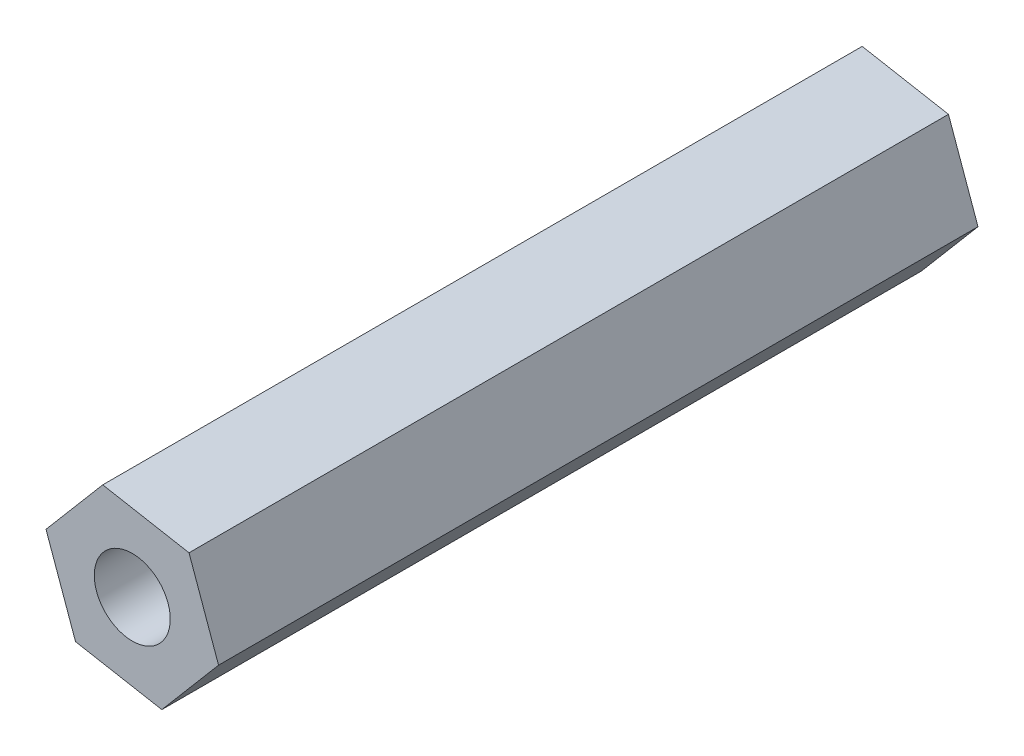
ISO-10303-21;
HEADER;
FILE_DESCRIPTION(('STEP AP214'),'2;1');
FILE_NAME('part.step','',(''),(''),'','','');
FILE_SCHEMA(('AUTOMOTIVE_DESIGN { 1 0 10303 214 1 1 1 1 }'));
ENDSEC;
DATA;
#1=APPLICATION_CONTEXT('core data for automotive mechanical design processes');
#2=APPLICATION_PROTOCOL_DEFINITION('international standard','automotive_design',2000,#1);
#3=PRODUCT_CONTEXT('',#1,'mechanical');
#4=PRODUCT('Part','Part','',(#3));
#5=PRODUCT_RELATED_PRODUCT_CATEGORY('part','',(#4));
#6=PRODUCT_DEFINITION_FORMATION('','',#4);
#7=PRODUCT_DEFINITION_CONTEXT('part definition',#1,'design');
#8=PRODUCT_DEFINITION('design','',#6,#7);
#9=PRODUCT_DEFINITION_SHAPE('','',#8);
#10=(LENGTH_UNIT() NAMED_UNIT(*) SI_UNIT(.MILLI.,.METRE.));
#11=(NAMED_UNIT(*) PLANE_ANGLE_UNIT() SI_UNIT($,.RADIAN.));
#12=(NAMED_UNIT(*) SI_UNIT($,.STERADIAN.) SOLID_ANGLE_UNIT());
#13=UNCERTAINTY_MEASURE_WITH_UNIT(LENGTH_MEASURE(1.E-05),#10,'distance_accuracy_value','');
#14=(GEOMETRIC_REPRESENTATION_CONTEXT(3) GLOBAL_UNCERTAINTY_ASSIGNED_CONTEXT((#13)) GLOBAL_UNIT_ASSIGNED_CONTEXT((#10,
#11,#12)) REPRESENTATION_CONTEXT('',''));
#15=CARTESIAN_POINT('',(0.,0.,0.));
#16=DIRECTION('',(0.,0.,1.));
#17=DIRECTION('',(1.,0.,0.));
#18=AXIS2_PLACEMENT_3D('',#15,#16,#17);
#19=CARTESIAN_POINT('',(14.100105118259,-7.40552271774973,30.));
#20=DIRECTION('',(-0.941553473498977,-0.336863557753005,0.));
#21=DIRECTION('',(0.336863557753005,-0.941553473498977,0.));
#22=AXIS2_PLACEMENT_3D('',#19,#20,#21);
#23=PLANE('',#22);
#24=DIRECTION('',(-0.336863557753005,0.941553473498977,0.));
#25=VECTOR('',#24,1.);
#26=CARTESIAN_POINT('',(14.100105118259,-7.40552271774973,0.));
#27=LINE('',#26,#25);
#28=CARTESIAN_POINT('',(14.100105118259,-7.40552271774973,0.));
#29=VERTEX_POINT('',#28);
#30=CARTESIAN_POINT('',(12.9331755237658,-4.14388580946336,0.));
#31=VERTEX_POINT('',#30);
#32=EDGE_CURVE('E117',#29,#31,#27,.T.);
#33=ORIENTED_EDGE('',*,*,#32,.T.);
#34=DIRECTION('',(0.,0.,-1.));
#35=VECTOR('',#34,1.);
#36=CARTESIAN_POINT('',(12.9331755237658,-4.14388580946336,30.));
#37=LINE('',#36,#35);
#38=CARTESIAN_POINT('',(12.9331755237658,-4.14388580946336,30.));
#39=VERTEX_POINT('',#38);
#40=EDGE_CURVE('E11',#39,#31,#37,.T.);
#41=ORIENTED_EDGE('',*,*,#40,.F.);
#42=DIRECTION('',(-0.336863557753005,0.941553473498977,0.));
#43=VECTOR('',#42,1.);
#44=CARTESIAN_POINT('',(14.100105118259,-7.40552271774973,30.));
#45=LINE('',#44,#43);
#46=CARTESIAN_POINT('',(14.100105118259,-7.40552271774973,30.));
#47=VERTEX_POINT('',#46);
#48=EDGE_CURVE('E128',#47,#39,#45,.T.);
#49=ORIENTED_EDGE('',*,*,#48,.F.);
#50=DIRECTION('',(0.,0.,-1.));
#51=VECTOR('',#50,1.);
#52=CARTESIAN_POINT('',(14.100105118259,-7.40552271774973,30.));
#53=LINE('',#52,#51);
#54=EDGE_CURVE('E113',#47,#29,#53,.T.);
#55=ORIENTED_EDGE('',*,*,#54,.T.);
#56=EDGE_LOOP('',(#33,#41,#49,#55));
#57=FACE_BOUND('',#56,.T.);
#58=ADVANCED_FACE('F33',(#57),#23,.F.);
#59=CARTESIAN_POINT('',(12.9331755237658,-4.14388580946336,30.));
#60=DIRECTION('',(-0.17904433812618,-0.983841005948094,0.));
#61=DIRECTION('',(0.983841005948094,-0.17904433812618,0.));
#62=AXIS2_PLACEMENT_3D('',#59,#60,#61);
#63=PLANE('',#62);
#64=DIRECTION('',(-0.983841005948094,0.17904433812618,0.));
#65=VECTOR('',#64,1.);
#66=CARTESIAN_POINT('',(12.9331755237658,-4.14388580946336,0.));
#67=LINE('',#66,#65);
#68=CARTESIAN_POINT('',(9.52505030602222,-3.52365802857919,0.));
#69=VERTEX_POINT('',#68);
#70=EDGE_CURVE('E120',#31,#69,#67,.T.);
#71=ORIENTED_EDGE('',*,*,#70,.T.);
#72=DIRECTION('',(0.,0.,-1.));
#73=VECTOR('',#72,1.);
#74=CARTESIAN_POINT('',(9.52505030602222,-3.52365802857919,30.));
#75=LINE('',#74,#73);
#76=CARTESIAN_POINT('',(9.52505030602222,-3.52365802857919,30.));
#77=VERTEX_POINT('',#76);
#78=EDGE_CURVE('E41',#77,#69,#75,.T.);
#79=ORIENTED_EDGE('',*,*,#78,.F.);
#80=DIRECTION('',(-0.983841005948094,0.17904433812618,0.));
#81=VECTOR('',#80,1.);
#82=CARTESIAN_POINT('',(12.9331755237658,-4.14388580946336,30.));
#83=LINE('',#82,#81);
#84=EDGE_CURVE('E86',#39,#77,#83,.T.);
#85=ORIENTED_EDGE('',*,*,#84,.F.);
#86=ORIENTED_EDGE('',*,*,#40,.T.);
#87=EDGE_LOOP('',(#71,#79,#85,#86));
#88=FACE_BOUND('',#87,.T.);
#89=ADVANCED_FACE('F153',(#88),#63,.F.);
#90=CARTESIAN_POINT('',(9.52505030602222,-3.52365802857919,30.));
#91=DIRECTION('',(0.762509135372797,-0.64697744819509,0.));
#92=DIRECTION('',(0.64697744819509,0.762509135372797,0.));
#93=AXIS2_PLACEMENT_3D('',#90,#91,#92);
#94=PLANE('',#93);
#95=DIRECTION('',(-0.64697744819509,-0.762509135372797,0.));
#96=VECTOR('',#95,1.);
#97=CARTESIAN_POINT('',(9.52505030602222,-3.52365802857919,0.));
#98=LINE('',#97,#96);
#99=CARTESIAN_POINT('',(7.28385468277191,-6.16506715598138,0.));
#100=VERTEX_POINT('',#99);
#101=EDGE_CURVE('E123',#69,#100,#98,.T.);
#102=ORIENTED_EDGE('',*,*,#101,.T.);
#103=DIRECTION('',(0.,0.,-1.));
#104=VECTOR('',#103,1.);
#105=CARTESIAN_POINT('',(7.28385468277191,-6.16506715598138,30.));
#106=LINE('',#105,#104);
#107=CARTESIAN_POINT('',(7.28385468277191,-6.16506715598138,30.));
#108=VERTEX_POINT('',#107);
#109=EDGE_CURVE('E108',#108,#100,#106,.T.);
#110=ORIENTED_EDGE('',*,*,#109,.F.);
#111=DIRECTION('',(-0.64697744819509,-0.762509135372797,0.));
#112=VECTOR('',#111,1.);
#113=CARTESIAN_POINT('',(9.52505030602222,-3.52365802857919,30.));
#114=LINE('',#113,#112);
#115=EDGE_CURVE('E99',#77,#108,#114,.T.);
#116=ORIENTED_EDGE('',*,*,#115,.F.);
#117=ORIENTED_EDGE('',*,*,#78,.T.);
#118=EDGE_LOOP('',(#102,#110,#116,#117));
#119=FACE_BOUND('',#118,.T.);
#120=ADVANCED_FACE('F134',(#119),#94,.F.);
#121=CARTESIAN_POINT('',(7.28385468277191,-6.16506715598138,30.));
#122=DIRECTION('',(0.941553473498977,0.336863557753005,0.));
#123=DIRECTION('',(-0.336863557753005,0.941553473498977,0.));
#124=AXIS2_PLACEMENT_3D('',#121,#122,#123);
#125=PLANE('',#124);
#126=DIRECTION('',(0.336863557753005,-0.941553473498977,0.));
#127=VECTOR('',#126,1.);
#128=CARTESIAN_POINT('',(7.28385468277191,-6.16506715598138,0.));
#129=LINE('',#128,#127);
#130=CARTESIAN_POINT('',(8.45078427726515,-9.42670406426776,0.));
#131=VERTEX_POINT('',#130);
#132=EDGE_CURVE('E107',#100,#131,#129,.T.);
#133=ORIENTED_EDGE('',*,*,#132,.T.);
#134=DIRECTION('',(0.,0.,-1.));
#135=VECTOR('',#134,1.);
#136=CARTESIAN_POINT('',(8.45078427726515,-9.42670406426776,30.));
#137=LINE('',#136,#135);
#138=CARTESIAN_POINT('',(8.45078427726515,-9.42670406426776,30.));
#139=VERTEX_POINT('',#138);
#140=EDGE_CURVE('E104',#139,#131,#137,.T.);
#141=ORIENTED_EDGE('',*,*,#140,.F.);
#142=DIRECTION('',(0.336863557753005,-0.941553473498977,0.));
#143=VECTOR('',#142,1.);
#144=CARTESIAN_POINT('',(7.28385468277191,-6.16506715598138,30.));
#145=LINE('',#144,#143);
#146=EDGE_CURVE('E93',#108,#139,#145,.T.);
#147=ORIENTED_EDGE('',*,*,#146,.F.);
#148=ORIENTED_EDGE('',*,*,#109,.T.);
#149=EDGE_LOOP('',(#133,#141,#147,#148));
#150=FACE_BOUND('',#149,.T.);
#151=ADVANCED_FACE('F105',(#150),#125,.F.);
#152=CARTESIAN_POINT('',(8.45078427726515,-9.42670406426776,30.));
#153=DIRECTION('',(0.17904433812618,0.983841005948094,0.));
#154=DIRECTION('',(-0.983841005948094,0.17904433812618,0.));
#155=AXIS2_PLACEMENT_3D('',#152,#153,#154);
#156=PLANE('',#155);
#157=DIRECTION('',(0.983841005948094,-0.17904433812618,0.));
#158=VECTOR('',#157,1.);
#159=CARTESIAN_POINT('',(8.45078427726515,-9.42670406426776,0.));
#160=LINE('',#159,#158);
#161=CARTESIAN_POINT('',(11.8589094950087,-10.0469318451519,0.));
#162=VERTEX_POINT('',#161);
#163=EDGE_CURVE('E72',#131,#162,#160,.T.);
#164=ORIENTED_EDGE('',*,*,#163,.T.);
#165=DIRECTION('',(0.,0.,-1.));
#166=VECTOR('',#165,1.);
#167=CARTESIAN_POINT('',(11.8589094950087,-10.0469318451519,30.));
#168=LINE('',#167,#166);
#169=CARTESIAN_POINT('',(11.8589094950087,-10.0469318451519,30.));
#170=VERTEX_POINT('',#169);
#171=EDGE_CURVE('E109',#170,#162,#168,.T.);
#172=ORIENTED_EDGE('',*,*,#171,.F.);
#173=DIRECTION('',(0.983841005948094,-0.17904433812618,0.));
#174=VECTOR('',#173,1.);
#175=CARTESIAN_POINT('',(8.45078427726515,-9.42670406426776,30.));
#176=LINE('',#175,#174);
#177=EDGE_CURVE('E97',#139,#170,#176,.T.);
#178=ORIENTED_EDGE('',*,*,#177,.F.);
#179=ORIENTED_EDGE('',*,*,#140,.T.);
#180=EDGE_LOOP('',(#164,#172,#178,#179));
#181=FACE_BOUND('',#180,.T.);
#182=ADVANCED_FACE('F111',(#181),#156,.F.);
#183=CARTESIAN_POINT('',(11.8589094950087,-10.0469318451519,30.));
#184=DIRECTION('',(-0.762509135372797,0.64697744819509,0.));
#185=DIRECTION('',(-0.64697744819509,-0.762509135372797,0.));
#186=AXIS2_PLACEMENT_3D('',#183,#184,#185);
#187=PLANE('',#186);
#188=DIRECTION('',(0.64697744819509,0.762509135372797,0.));
#189=VECTOR('',#188,1.);
#190=CARTESIAN_POINT('',(11.8589094950087,-10.0469318451519,0.));
#191=LINE('',#190,#189);
#192=EDGE_CURVE('E78',#162,#29,#191,.T.);
#193=ORIENTED_EDGE('',*,*,#192,.T.);
#194=ORIENTED_EDGE('',*,*,#54,.F.);
#195=DIRECTION('',(0.64697744819509,0.762509135372797,0.));
#196=VECTOR('',#195,1.);
#197=CARTESIAN_POINT('',(11.8589094950087,-10.0469318451519,30.));
#198=LINE('',#197,#196);
#199=EDGE_CURVE('E49',#170,#47,#198,.T.);
#200=ORIENTED_EDGE('',*,*,#199,.F.);
#201=ORIENTED_EDGE('',*,*,#171,.T.);
#202=EDGE_LOOP('',(#193,#194,#200,#201));
#203=FACE_BOUND('',#202,.T.);
#204=ADVANCED_FACE('F141',(#203),#187,.F.);
#205=CARTESIAN_POINT('',(0.,0.,30.));
#206=DIRECTION('',(0.,0.,1.));
#207=DIRECTION('',(1.,0.,0.));
#208=AXIS2_PLACEMENT_3D('',#205,#206,#207);
#209=PLANE('',#208);
#210=CARTESIAN_POINT('',(10.6919799005155,-6.78529493686556,30.));
#211=DIRECTION('',(0.,0.,1.));
#212=DIRECTION('',(1.,0.,0.));
#213=AXIS2_PLACEMENT_3D('',#210,#211,#212);
#214=CIRCLE('',#213,1.5);
#215=CARTESIAN_POINT('',(12.1919799005155,-6.78529493686556,30.));
#216=VERTEX_POINT('',#215);
#217=EDGE_CURVE('E121',#216,#216,#214,.T.);
#218=ORIENTED_EDGE('',*,*,#217,.F.);
#219=EDGE_LOOP('',(#218));
#220=FACE_BOUND('',#219,.T.);
#221=ORIENTED_EDGE('',*,*,#48,.T.);
#222=ORIENTED_EDGE('',*,*,#84,.T.);
#223=ORIENTED_EDGE('',*,*,#115,.T.);
#224=ORIENTED_EDGE('',*,*,#146,.T.);
#225=ORIENTED_EDGE('',*,*,#177,.T.);
#226=ORIENTED_EDGE('',*,*,#199,.T.);
#227=EDGE_LOOP('',(#221,#222,#223,#224,#225,#226));
#228=FACE_BOUND('',#227,.T.);
#229=ADVANCED_FACE('F95',(#220,#228),#209,.T.);
#230=CARTESIAN_POINT('',(0.,0.,0.));
#231=DIRECTION('',(0.,0.,1.));
#232=DIRECTION('',(1.,0.,0.));
#233=AXIS2_PLACEMENT_3D('',#230,#231,#232);
#234=PLANE('',#233);
#235=CARTESIAN_POINT('',(10.6919799005155,-6.78529493686556,0.));
#236=DIRECTION('',(0.,0.,-1.));
#237=DIRECTION('',(-1.,0.,0.));
#238=AXIS2_PLACEMENT_3D('',#235,#236,#237);
#239=CIRCLE('',#238,1.5);
#240=CARTESIAN_POINT('',(9.19197990051546,-6.78529493686556,0.));
#241=VERTEX_POINT('',#240);
#242=EDGE_CURVE('E208',#241,#241,#239,.T.);
#243=ORIENTED_EDGE('',*,*,#242,.F.);
#244=EDGE_LOOP('',(#243));
#245=FACE_BOUND('',#244,.T.);
#246=ORIENTED_EDGE('',*,*,#32,.F.);
#247=ORIENTED_EDGE('',*,*,#192,.F.);
#248=ORIENTED_EDGE('',*,*,#163,.F.);
#249=ORIENTED_EDGE('',*,*,#132,.F.);
#250=ORIENTED_EDGE('',*,*,#101,.F.);
#251=ORIENTED_EDGE('',*,*,#70,.F.);
#252=EDGE_LOOP('',(#246,#247,#248,#249,#250,#251));
#253=FACE_BOUND('',#252,.T.);
#254=ADVANCED_FACE('F137',(#245,#253),#234,.F.);
#255=CARTESIAN_POINT('',(10.6919799005155,-6.78529493686556,40.));
#256=DIRECTION('',(0.,0.,-1.));
#257=DIRECTION('',(-1.,0.,0.));
#258=AXIS2_PLACEMENT_3D('',#255,#256,#257);
#259=CYLINDRICAL_SURFACE('',#258,1.5);
#260=ORIENTED_EDGE('',*,*,#217,.T.);
#261=EDGE_LOOP('',(#260));
#262=FACE_BOUND('',#261,.T.);
#263=ORIENTED_EDGE('',*,*,#242,.T.);
#264=EDGE_LOOP('',(#263));
#265=FACE_BOUND('',#264,.T.);
#266=ADVANCED_FACE('F190',(#262,#265),#259,.F.);
#267=CLOSED_SHELL('',(#58,#89,#120,#151,#182,#204,#229,#254,#266));
#268=MANIFOLD_SOLID_BREP('B2',#267);
#269=ADVANCED_BREP_SHAPE_REPRESENTATION('',(#18,#268),#14);
#270=SHAPE_DEFINITION_REPRESENTATION(#9,#269);
ENDSEC;
END-ISO-10303-21;
